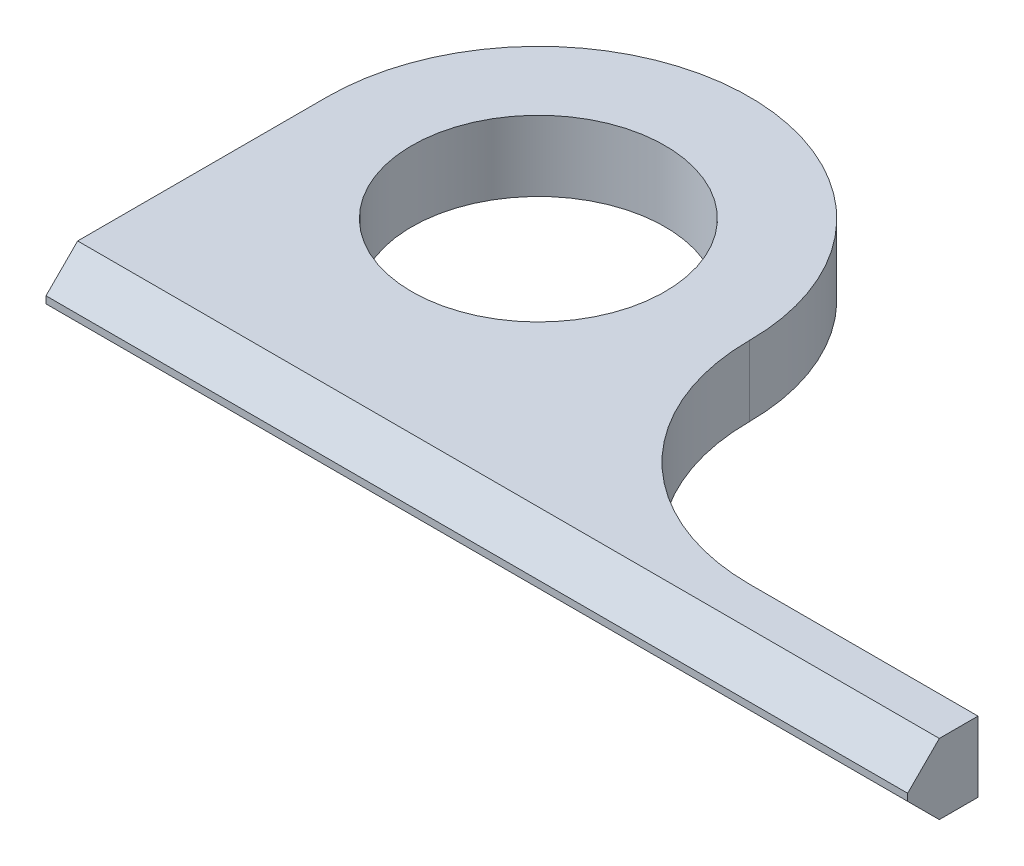
ISO-10303-21;
HEADER;
FILE_DESCRIPTION(('STEP AP214'),'2;1');
FILE_NAME('part.step','',(''),(''),'','','');
FILE_SCHEMA(('AUTOMOTIVE_DESIGN { 1 0 10303 214 1 1 1 1 }'));
ENDSEC;
DATA;
#1=APPLICATION_CONTEXT('core data for automotive mechanical design processes');
#2=APPLICATION_PROTOCOL_DEFINITION('international standard','automotive_design',2000,#1);
#3=PRODUCT_CONTEXT('',#1,'mechanical');
#4=PRODUCT('Part','Part','',(#3));
#5=PRODUCT_RELATED_PRODUCT_CATEGORY('part','',(#4));
#6=PRODUCT_DEFINITION_FORMATION('','',#4);
#7=PRODUCT_DEFINITION_CONTEXT('part definition',#1,'design');
#8=PRODUCT_DEFINITION('design','',#6,#7);
#9=PRODUCT_DEFINITION_SHAPE('','',#8);
#10=(LENGTH_UNIT() NAMED_UNIT(*) SI_UNIT(.MILLI.,.METRE.));
#11=(NAMED_UNIT(*) PLANE_ANGLE_UNIT() SI_UNIT($,.RADIAN.));
#12=(NAMED_UNIT(*) SI_UNIT($,.STERADIAN.) SOLID_ANGLE_UNIT());
#13=UNCERTAINTY_MEASURE_WITH_UNIT(LENGTH_MEASURE(1.E-05),#10,'distance_accuracy_value','');
#14=(GEOMETRIC_REPRESENTATION_CONTEXT(3) GLOBAL_UNCERTAINTY_ASSIGNED_CONTEXT((#13)) GLOBAL_UNIT_ASSIGNED_CONTEXT((#10,
#11,#12)) REPRESENTATION_CONTEXT('',''));
#15=CARTESIAN_POINT('',(0.,0.,0.));
#16=DIRECTION('',(0.,0.,1.));
#17=DIRECTION('',(1.,0.,0.));
#18=AXIS2_PLACEMENT_3D('',#15,#16,#17);
#19=CARTESIAN_POINT('',(62.5,4.5,75.5));
#20=DIRECTION('',(0.,-0.707106781186548,0.707106781186548));
#21=DIRECTION('',(0.,-0.707106781186548,-0.707106781186548));
#22=AXIS2_PLACEMENT_3D('',#19,#20,#21);
#23=PLANE('',#22);
#24=DIRECTION('',(1.,0.,0.));
#25=VECTOR('',#24,1.);
#26=CARTESIAN_POINT('',(-60.,9.,80.));
#27=LINE('',#26,#25);
#28=CARTESIAN_POINT('',(-60.,9.,80.));
#29=VERTEX_POINT('',#28);
#30=CARTESIAN_POINT('',(185.,9.,80.));
#31=VERTEX_POINT('',#30);
#32=EDGE_CURVE('E138',#29,#31,#27,.T.);
#33=ORIENTED_EDGE('',*,*,#32,.F.);
#34=DIRECTION('',(0.,0.707106781186548,0.707106781186547));
#35=VECTOR('',#34,1.);
#36=CARTESIAN_POINT('',(-60.,0.,71.));
#37=LINE('',#36,#35);
#38=CARTESIAN_POINT('',(-60.,0.,71.));
#39=VERTEX_POINT('',#38);
#40=EDGE_CURVE('E135',#39,#29,#37,.T.);
#41=ORIENTED_EDGE('',*,*,#40,.F.);
#42=DIRECTION('',(1.,0.,0.));
#43=VECTOR('',#42,1.);
#44=CARTESIAN_POINT('',(0.,0.,71.));
#45=LINE('',#44,#43);
#46=CARTESIAN_POINT('',(185.,0.,71.));
#47=VERTEX_POINT('',#46);
#48=EDGE_CURVE('E126',#39,#47,#45,.T.);
#49=ORIENTED_EDGE('',*,*,#48,.T.);
#50=DIRECTION('',(0.,-0.707106781186548,-0.707106781186547));
#51=VECTOR('',#50,1.);
#52=CARTESIAN_POINT('',(185.,9.,80.));
#53=LINE('',#52,#51);
#54=EDGE_CURVE('E125',#31,#47,#53,.T.);
#55=ORIENTED_EDGE('',*,*,#54,.F.);
#56=EDGE_LOOP('',(#33,#41,#49,#55));
#57=FACE_BOUND('',#56,.T.);
#58=ADVANCED_FACE('F17',(#57),#23,.T.);
#59=CARTESIAN_POINT('',(-60.,0.,80.));
#60=DIRECTION('',(0.,0.,1.));
#61=DIRECTION('',(1.,0.,0.));
#62=AXIS2_PLACEMENT_3D('',#59,#60,#61);
#63=PLANE('',#62);
#64=DIRECTION('',(0.,1.,0.));
#65=VECTOR('',#64,1.);
#66=CARTESIAN_POINT('',(185.,0.,80.));
#67=LINE('',#66,#65);
#68=CARTESIAN_POINT('',(185.,11.,80.));
#69=VERTEX_POINT('',#68);
#70=EDGE_CURVE('E122',#69,#31,#67,.F.);
#71=ORIENTED_EDGE('',*,*,#70,.F.);
#72=DIRECTION('',(1.,0.,0.));
#73=VECTOR('',#72,1.);
#74=CARTESIAN_POINT('',(62.5,11.,80.));
#75=LINE('',#74,#73);
#76=CARTESIAN_POINT('',(-60.0000000000001,11.,80.));
#77=VERTEX_POINT('',#76);
#78=EDGE_CURVE('E119',#77,#69,#75,.T.);
#79=ORIENTED_EDGE('',*,*,#78,.F.);
#80=DIRECTION('',(0.,1.,0.));
#81=VECTOR('',#80,1.);
#82=CARTESIAN_POINT('',(-60.,0.,80.));
#83=LINE('',#82,#81);
#84=EDGE_CURVE('E133',#29,#77,#83,.T.);
#85=ORIENTED_EDGE('',*,*,#84,.F.);
#86=ORIENTED_EDGE('',*,*,#32,.T.);
#87=EDGE_LOOP('',(#71,#79,#85,#86));
#88=FACE_BOUND('',#87,.T.);
#89=ADVANCED_FACE('F225',(#88),#63,.T.);
#90=CARTESIAN_POINT('',(0.,0.,0.));
#91=DIRECTION('',(0.,1.,0.));
#92=DIRECTION('',(0.,0.,1.));
#93=AXIS2_PLACEMENT_3D('',#90,#91,#92);
#94=PLANE('',#93);
#95=CARTESIAN_POINT('',(0.,0.,0.));
#96=DIRECTION('',(0.,1.,0.));
#97=DIRECTION('',(0.,0.,1.));
#98=AXIS2_PLACEMENT_3D('',#95,#96,#97);
#99=CIRCLE('',#98,36.);
#100=CARTESIAN_POINT('',(0.,0.,36.));
#101=VERTEX_POINT('',#100);
#102=EDGE_CURVE('E113',#101,#101,#99,.T.);
#103=ORIENTED_EDGE('',*,*,#102,.T.);
#104=EDGE_LOOP('',(#103));
#105=FACE_BOUND('',#104,.T.);
#106=CARTESIAN_POINT('',(0.,0.,0.));
#107=DIRECTION('',(0.,1.,0.));
#108=DIRECTION('',(0.,0.,1.));
#109=AXIS2_PLACEMENT_3D('',#106,#107,#108);
#110=CIRCLE('',#109,60.);
#111=CARTESIAN_POINT('',(60.,0.,0.));
#112=VERTEX_POINT('',#111);
#113=CARTESIAN_POINT('',(-60.,0.,0.));
#114=VERTEX_POINT('',#113);
#115=EDGE_CURVE('E87',#112,#114,#110,.T.);
#116=ORIENTED_EDGE('',*,*,#115,.F.);
#117=CARTESIAN_POINT('',(120.,0.,0.));
#118=DIRECTION('',(0.,1.,0.));
#119=DIRECTION('',(0.,0.,1.));
#120=AXIS2_PLACEMENT_3D('',#117,#118,#119);
#121=CIRCLE('',#120,60.);
#122=CARTESIAN_POINT('',(120.,0.,60.));
#123=VERTEX_POINT('',#122);
#124=EDGE_CURVE('E20',#112,#123,#121,.T.);
#125=ORIENTED_EDGE('',*,*,#124,.T.);
#126=DIRECTION('',(-1.,0.,0.));
#127=VECTOR('',#126,1.);
#128=CARTESIAN_POINT('',(185.,0.,60.));
#129=LINE('',#128,#127);
#130=CARTESIAN_POINT('',(185.,0.,60.));
#131=VERTEX_POINT('',#130);
#132=EDGE_CURVE('E84',#131,#123,#129,.T.);
#133=ORIENTED_EDGE('',*,*,#132,.F.);
#134=DIRECTION('',(0.,0.,-1.));
#135=VECTOR('',#134,1.);
#136=CARTESIAN_POINT('',(185.,0.,80.));
#137=LINE('',#136,#135);
#138=EDGE_CURVE('E106',#47,#131,#137,.T.);
#139=ORIENTED_EDGE('',*,*,#138,.F.);
#140=ORIENTED_EDGE('',*,*,#48,.F.);
#141=DIRECTION('',(0.,0.,1.));
#142=VECTOR('',#141,1.);
#143=CARTESIAN_POINT('',(-60.,0.,0.));
#144=LINE('',#143,#142);
#145=EDGE_CURVE('E144',#114,#39,#144,.T.);
#146=ORIENTED_EDGE('',*,*,#145,.F.);
#147=EDGE_LOOP('',(#116,#125,#133,#139,#140,#146));
#148=FACE_BOUND('',#147,.T.);
#149=ADVANCED_FACE('F82',(#105,#148),#94,.F.);
#150=CARTESIAN_POINT('',(185.,0.,80.));
#151=DIRECTION('',(1.,0.,0.));
#152=DIRECTION('',(0.,0.,-1.));
#153=AXIS2_PLACEMENT_3D('',#150,#151,#152);
#154=PLANE('',#153);
#155=DIRECTION('',(0.,0.,1.));
#156=VECTOR('',#155,1.);
#157=CARTESIAN_POINT('',(185.,20.,0.));
#158=LINE('',#157,#156);
#159=CARTESIAN_POINT('',(185.,20.,71.));
#160=VERTEX_POINT('',#159);
#161=CARTESIAN_POINT('',(185.,20.,60.));
#162=VERTEX_POINT('',#161);
#163=EDGE_CURVE('E109',#160,#162,#158,.F.);
#164=ORIENTED_EDGE('',*,*,#163,.F.);
#165=DIRECTION('',(0.,-0.707106781186548,0.707106781186548));
#166=VECTOR('',#165,1.);
#167=CARTESIAN_POINT('',(185.,15.5,75.5));
#168=LINE('',#167,#166);
#169=EDGE_CURVE('E116',#69,#160,#168,.F.);
#170=ORIENTED_EDGE('',*,*,#169,.F.);
#171=ORIENTED_EDGE('',*,*,#70,.T.);
#172=ORIENTED_EDGE('',*,*,#54,.T.);
#173=ORIENTED_EDGE('',*,*,#138,.T.);
#174=DIRECTION('',(0.,1.,0.));
#175=VECTOR('',#174,1.);
#176=CARTESIAN_POINT('',(185.,0.,60.));
#177=LINE('',#176,#175);
#178=EDGE_CURVE('E94',#162,#131,#177,.F.);
#179=ORIENTED_EDGE('',*,*,#178,.F.);
#180=EDGE_LOOP('',(#164,#170,#171,#172,#173,#179));
#181=FACE_BOUND('',#180,.T.);
#182=ADVANCED_FACE('F195',(#181),#154,.T.);
#183=CARTESIAN_POINT('',(185.,0.,60.));
#184=DIRECTION('',(0.,0.,-1.));
#185=DIRECTION('',(-1.,0.,0.));
#186=AXIS2_PLACEMENT_3D('',#183,#184,#185);
#187=PLANE('',#186);
#188=ORIENTED_EDGE('',*,*,#178,.T.);
#189=ORIENTED_EDGE('',*,*,#132,.T.);
#190=DIRECTION('',(0.,1.,0.));
#191=VECTOR('',#190,1.);
#192=CARTESIAN_POINT('',(120.,0.,60.));
#193=LINE('',#192,#191);
#194=CARTESIAN_POINT('',(120.,20.,60.));
#195=VERTEX_POINT('',#194);
#196=EDGE_CURVE('E89',#123,#195,#193,.T.);
#197=ORIENTED_EDGE('',*,*,#196,.T.);
#198=DIRECTION('',(1.,0.,0.));
#199=VECTOR('',#198,1.);
#200=CARTESIAN_POINT('',(0.,20.,60.));
#201=LINE('',#200,#199);
#202=EDGE_CURVE('E112',#162,#195,#201,.F.);
#203=ORIENTED_EDGE('',*,*,#202,.F.);
#204=EDGE_LOOP('',(#188,#189,#197,#203));
#205=FACE_BOUND('',#204,.T.);
#206=ADVANCED_FACE('F91',(#205),#187,.T.);
#207=CARTESIAN_POINT('',(120.,0.,0.));
#208=DIRECTION('',(0.,1.,0.));
#209=DIRECTION('',(0.,0.,1.));
#210=AXIS2_PLACEMENT_3D('',#207,#208,#209);
#211=CYLINDRICAL_SURFACE('',#210,60.);
#212=CARTESIAN_POINT('',(120.,20.,0.));
#213=DIRECTION('',(0.,1.,0.));
#214=DIRECTION('',(0.,0.,1.));
#215=AXIS2_PLACEMENT_3D('',#212,#213,#214);
#216=CIRCLE('',#215,60.);
#217=CARTESIAN_POINT('',(60.,20.,0.));
#218=VERTEX_POINT('',#217);
#219=EDGE_CURVE('E98',#195,#218,#216,.F.);
#220=ORIENTED_EDGE('',*,*,#219,.F.);
#221=ORIENTED_EDGE('',*,*,#196,.F.);
#222=ORIENTED_EDGE('',*,*,#124,.F.);
#223=DIRECTION('',(0.,1.,0.));
#224=VECTOR('',#223,1.);
#225=CARTESIAN_POINT('',(60.,0.,-1.42875498853079E-13));
#226=LINE('',#225,#224);
#227=EDGE_CURVE('E100',#218,#112,#226,.F.);
#228=ORIENTED_EDGE('',*,*,#227,.F.);
#229=EDGE_LOOP('',(#220,#221,#222,#228));
#230=FACE_BOUND('',#229,.T.);
#231=ADVANCED_FACE('F96',(#230),#211,.F.);
#232=CARTESIAN_POINT('',(0.,0.,0.));
#233=DIRECTION('',(0.,1.,0.));
#234=DIRECTION('',(0.,0.,1.));
#235=AXIS2_PLACEMENT_3D('',#232,#233,#234);
#236=CYLINDRICAL_SURFACE('',#235,60.);
#237=ORIENTED_EDGE('',*,*,#227,.T.);
#238=ORIENTED_EDGE('',*,*,#115,.T.);
#239=DIRECTION('',(0.,1.,0.));
#240=VECTOR('',#239,1.);
#241=CARTESIAN_POINT('',(-60.,0.,0.));
#242=LINE('',#241,#240);
#243=CARTESIAN_POINT('',(-60.,20.,0.));
#244=VERTEX_POINT('',#243);
#245=EDGE_CURVE('E149',#244,#114,#242,.F.);
#246=ORIENTED_EDGE('',*,*,#245,.F.);
#247=CARTESIAN_POINT('',(0.,20.,0.));
#248=DIRECTION('',(0.,1.,0.));
#249=DIRECTION('',(0.,0.,1.));
#250=AXIS2_PLACEMENT_3D('',#247,#248,#249);
#251=CIRCLE('',#250,60.);
#252=EDGE_CURVE('E164',#218,#244,#251,.T.);
#253=ORIENTED_EDGE('',*,*,#252,.F.);
#254=EDGE_LOOP('',(#237,#238,#246,#253));
#255=FACE_BOUND('',#254,.T.);
#256=ADVANCED_FACE('F202',(#255),#236,.T.);
#257=CARTESIAN_POINT('',(-60.,0.,0.));
#258=DIRECTION('',(-1.,0.,0.));
#259=DIRECTION('',(0.,0.,1.));
#260=AXIS2_PLACEMENT_3D('',#257,#258,#259);
#261=PLANE('',#260);
#262=ORIENTED_EDGE('',*,*,#84,.T.);
#263=DIRECTION('',(0.,-0.707106781186548,0.707106781186548));
#264=VECTOR('',#263,1.);
#265=CARTESIAN_POINT('',(-60.0000000000001,15.5,75.5));
#266=LINE('',#265,#264);
#267=CARTESIAN_POINT('',(-60.,20.,71.));
#268=VERTEX_POINT('',#267);
#269=EDGE_CURVE('E35',#268,#77,#266,.T.);
#270=ORIENTED_EDGE('',*,*,#269,.F.);
#271=DIRECTION('',(0.,0.,1.));
#272=VECTOR('',#271,1.);
#273=CARTESIAN_POINT('',(-60.,20.,0.));
#274=LINE('',#273,#272);
#275=EDGE_CURVE('E167',#244,#268,#274,.T.);
#276=ORIENTED_EDGE('',*,*,#275,.F.);
#277=ORIENTED_EDGE('',*,*,#245,.T.);
#278=ORIENTED_EDGE('',*,*,#145,.T.);
#279=ORIENTED_EDGE('',*,*,#40,.T.);
#280=EDGE_LOOP('',(#262,#270,#276,#277,#278,#279));
#281=FACE_BOUND('',#280,.T.);
#282=ADVANCED_FACE('F200',(#281),#261,.T.);
#283=CARTESIAN_POINT('',(62.5,15.5,75.5));
#284=DIRECTION('',(0.,0.707106781186548,0.707106781186548));
#285=DIRECTION('',(0.,-0.707106781186548,0.707106781186548));
#286=AXIS2_PLACEMENT_3D('',#283,#284,#285);
#287=PLANE('',#286);
#288=ORIENTED_EDGE('',*,*,#78,.T.);
#289=ORIENTED_EDGE('',*,*,#169,.T.);
#290=DIRECTION('',(1.,0.,0.));
#291=VECTOR('',#290,1.);
#292=CARTESIAN_POINT('',(0.,20.,71.));
#293=LINE('',#292,#291);
#294=EDGE_CURVE('E26',#268,#160,#293,.T.);
#295=ORIENTED_EDGE('',*,*,#294,.F.);
#296=ORIENTED_EDGE('',*,*,#269,.T.);
#297=EDGE_LOOP('',(#288,#289,#295,#296));
#298=FACE_BOUND('',#297,.T.);
#299=ADVANCED_FACE('F183',(#298),#287,.T.);
#300=CARTESIAN_POINT('',(0.,0.,0.));
#301=DIRECTION('',(0.,1.,0.));
#302=DIRECTION('',(0.,0.,1.));
#303=AXIS2_PLACEMENT_3D('',#300,#301,#302);
#304=CYLINDRICAL_SURFACE('',#303,36.);
#305=CARTESIAN_POINT('',(0.,20.,0.));
#306=DIRECTION('',(0.,1.,0.));
#307=DIRECTION('',(0.,0.,1.));
#308=AXIS2_PLACEMENT_3D('',#305,#306,#307);
#309=CIRCLE('',#308,36.);
#310=CARTESIAN_POINT('',(0.,20.,36.));
#311=VERTEX_POINT('',#310);
#312=EDGE_CURVE('E11',#311,#311,#309,.F.);
#313=ORIENTED_EDGE('',*,*,#312,.F.);
#314=EDGE_LOOP('',(#313));
#315=FACE_BOUND('',#314,.T.);
#316=ORIENTED_EDGE('',*,*,#102,.F.);
#317=EDGE_LOOP('',(#316));
#318=FACE_BOUND('',#317,.T.);
#319=ADVANCED_FACE('F209',(#315,#318),#304,.F.);
#320=CARTESIAN_POINT('',(0.,20.,0.));
#321=DIRECTION('',(0.,1.,0.));
#322=DIRECTION('',(0.,0.,1.));
#323=AXIS2_PLACEMENT_3D('',#320,#321,#322);
#324=PLANE('',#323);
#325=ORIENTED_EDGE('',*,*,#312,.T.);
#326=EDGE_LOOP('',(#325));
#327=FACE_BOUND('',#326,.T.);
#328=ORIENTED_EDGE('',*,*,#275,.T.);
#329=ORIENTED_EDGE('',*,*,#294,.T.);
#330=ORIENTED_EDGE('',*,*,#163,.T.);
#331=ORIENTED_EDGE('',*,*,#202,.T.);
#332=ORIENTED_EDGE('',*,*,#219,.T.);
#333=ORIENTED_EDGE('',*,*,#252,.T.);
#334=EDGE_LOOP('',(#328,#329,#330,#331,#332,#333));
#335=FACE_BOUND('',#334,.T.);
#336=ADVANCED_FACE('F188',(#327,#335),#324,.T.);
#337=CLOSED_SHELL('',(#58,#89,#149,#182,#206,#231,#256,#282,#299,#319,#336));
#338=MANIFOLD_SOLID_BREP('B1',#337);
#339=ADVANCED_BREP_SHAPE_REPRESENTATION('',(#18,#338),#14);
#340=SHAPE_DEFINITION_REPRESENTATION(#9,#339);
ENDSEC;
END-ISO-10303-21;
